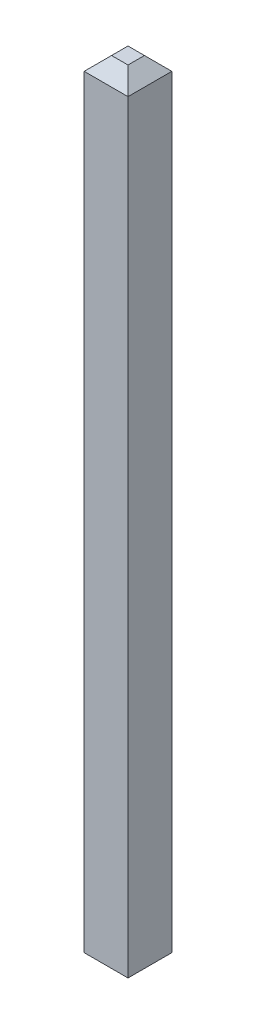
ISO-10303-21;
HEADER;
FILE_DESCRIPTION(('STEP AP214'),'2;1');
FILE_NAME('part.step','',(''),(''),'','','');
FILE_SCHEMA(('AUTOMOTIVE_DESIGN { 1 0 10303 214 1 1 1 1 }'));
ENDSEC;
DATA;
#1=APPLICATION_CONTEXT('core data for automotive mechanical design processes');
#2=APPLICATION_PROTOCOL_DEFINITION('international standard','automotive_design',2000,#1);
#3=PRODUCT_CONTEXT('',#1,'mechanical');
#4=PRODUCT('Part','Part','',(#3));
#5=PRODUCT_RELATED_PRODUCT_CATEGORY('part','',(#4));
#6=PRODUCT_DEFINITION_FORMATION('','',#4);
#7=PRODUCT_DEFINITION_CONTEXT('part definition',#1,'design');
#8=PRODUCT_DEFINITION('design','',#6,#7);
#9=PRODUCT_DEFINITION_SHAPE('','',#8);
#10=(LENGTH_UNIT() NAMED_UNIT(*) SI_UNIT(.MILLI.,.METRE.));
#11=(NAMED_UNIT(*) PLANE_ANGLE_UNIT() SI_UNIT($,.RADIAN.));
#12=(NAMED_UNIT(*) SI_UNIT($,.STERADIAN.) SOLID_ANGLE_UNIT());
#13=UNCERTAINTY_MEASURE_WITH_UNIT(LENGTH_MEASURE(1.E-05),#10,'distance_accuracy_value','');
#14=(GEOMETRIC_REPRESENTATION_CONTEXT(3) GLOBAL_UNCERTAINTY_ASSIGNED_CONTEXT((#13)) GLOBAL_UNIT_ASSIGNED_CONTEXT((#10,
#11,#12)) REPRESENTATION_CONTEXT('',''));
#15=CARTESIAN_POINT('',(0.,0.,0.));
#16=DIRECTION('',(0.,0.,1.));
#17=DIRECTION('',(1.,0.,0.));
#18=AXIS2_PLACEMENT_3D('',#15,#16,#17);
#19=CARTESIAN_POINT('',(9.01,-4.27,-0.32));
#20=DIRECTION('',(-0.707106781186548,0.707106781186548,0.));
#21=DIRECTION('',(-0.707106781186548,-0.707106781186548,0.));
#22=AXIS2_PLACEMENT_3D('',#19,#20,#21);
#23=PLANE('',#22);
#24=DIRECTION('',(0.,0.,1.));
#25=VECTOR('',#24,1.);
#26=CARTESIAN_POINT('',(9.21000000000001,-4.07,-0.32));
#27=LINE('',#26,#25);
#28=CARTESIAN_POINT('',(9.21,-4.07,-0.32));
#29=VERTEX_POINT('',#28);
#30=CARTESIAN_POINT('',(9.21,-4.07,0.32));
#31=VERTEX_POINT('',#30);
#32=EDGE_CURVE('E119',#29,#31,#27,.T.);
#33=ORIENTED_EDGE('',*,*,#32,.T.);
#34=DIRECTION('',(-0.577350269189628,-0.577350269189625,-0.577350269189625));
#35=VECTOR('',#34,1.);
#36=CARTESIAN_POINT('',(9.21,-4.07,0.32));
#37=LINE('',#36,#35);
#38=CARTESIAN_POINT('',(9.01,-4.27,0.12));
#39=VERTEX_POINT('',#38);
#40=EDGE_CURVE('E95',#31,#39,#37,.T.);
#41=ORIENTED_EDGE('',*,*,#40,.T.);
#42=DIRECTION('',(0.,0.,1.));
#43=VECTOR('',#42,1.);
#44=CARTESIAN_POINT('',(9.01,-4.27,-0.32));
#45=LINE('',#44,#43);
#46=CARTESIAN_POINT('',(9.01,-4.27,-0.12));
#47=VERTEX_POINT('',#46);
#48=EDGE_CURVE('E20',#39,#47,#45,.F.);
#49=ORIENTED_EDGE('',*,*,#48,.T.);
#50=DIRECTION('',(-0.577350269189628,-0.577350269189625,0.577350269189624));
#51=VECTOR('',#50,1.);
#52=CARTESIAN_POINT('',(9.21,-4.07,-0.32));
#53=LINE('',#52,#51);
#54=EDGE_CURVE('E84',#29,#47,#53,.T.);
#55=ORIENTED_EDGE('',*,*,#54,.F.);
#56=EDGE_LOOP('',(#33,#41,#49,#55));
#57=FACE_BOUND('',#56,.T.);
#58=ADVANCED_FACE('F17',(#57),#23,.F.);
#59=CARTESIAN_POINT('',(9.21,7.07,-0.32));
#60=DIRECTION('',(-0.707106781186548,-0.707106781186548,0.));
#61=DIRECTION('',(0.707106781186548,-0.707106781186548,0.));
#62=AXIS2_PLACEMENT_3D('',#59,#60,#61);
#63=PLANE('',#62);
#64=DIRECTION('',(0.,0.,1.));
#65=VECTOR('',#64,1.);
#66=CARTESIAN_POINT('',(9.21,7.07,-0.32));
#67=LINE('',#66,#65);
#68=CARTESIAN_POINT('',(9.21,7.07,0.32));
#69=VERTEX_POINT('',#68);
#70=CARTESIAN_POINT('',(9.21,7.07,-0.32));
#71=VERTEX_POINT('',#70);
#72=EDGE_CURVE('E121',#69,#71,#67,.F.);
#73=ORIENTED_EDGE('',*,*,#72,.T.);
#74=DIRECTION('',(0.577350269189629,-0.577350269189626,-0.577350269189623));
#75=VECTOR('',#74,1.);
#76=CARTESIAN_POINT('',(9.01,7.27,-0.12));
#77=LINE('',#76,#75);
#78=CARTESIAN_POINT('',(9.01,7.27,-0.12));
#79=VERTEX_POINT('',#78);
#80=EDGE_CURVE('E78',#79,#71,#77,.T.);
#81=ORIENTED_EDGE('',*,*,#80,.F.);
#82=DIRECTION('',(0.,0.,1.));
#83=VECTOR('',#82,1.);
#84=CARTESIAN_POINT('',(9.01,7.27,-0.32));
#85=LINE('',#84,#83);
#86=CARTESIAN_POINT('',(9.01,7.27,0.12));
#87=VERTEX_POINT('',#86);
#88=EDGE_CURVE('E108',#79,#87,#85,.T.);
#89=ORIENTED_EDGE('',*,*,#88,.T.);
#90=DIRECTION('',(0.577350269189629,-0.577350269189626,0.577350269189623));
#91=VECTOR('',#90,1.);
#92=CARTESIAN_POINT('',(9.01,7.27,0.119999999999999));
#93=LINE('',#92,#91);
#94=EDGE_CURVE('E116',#87,#69,#93,.T.);
#95=ORIENTED_EDGE('',*,*,#94,.T.);
#96=EDGE_LOOP('',(#73,#81,#89,#95));
#97=FACE_BOUND('',#96,.T.);
#98=ADVANCED_FACE('F214',(#97),#63,.F.);
#99=CARTESIAN_POINT('',(9.21,-4.27,-0.32));
#100=DIRECTION('',(0.,1.,0.));
#101=DIRECTION('',(0.,0.,1.));
#102=AXIS2_PLACEMENT_3D('',#99,#100,#101);
#103=PLANE('',#102);
#104=DIRECTION('',(1.,0.,0.));
#105=VECTOR('',#104,1.);
#106=CARTESIAN_POINT('',(9.21,-4.27,0.12));
#107=LINE('',#106,#105);
#108=CARTESIAN_POINT('',(8.77,-4.27,0.12));
#109=VERTEX_POINT('',#108);
#110=EDGE_CURVE('E110',#39,#109,#107,.F.);
#111=ORIENTED_EDGE('',*,*,#110,.T.);
#112=DIRECTION('',(0.,0.,1.));
#113=VECTOR('',#112,1.);
#114=CARTESIAN_POINT('',(8.77,-4.27,-0.32));
#115=LINE('',#114,#113);
#116=CARTESIAN_POINT('',(8.77,-4.27,-0.12));
#117=VERTEX_POINT('',#116);
#118=EDGE_CURVE('E101',#109,#117,#115,.F.);
#119=ORIENTED_EDGE('',*,*,#118,.T.);
#120=DIRECTION('',(1.,0.,0.));
#121=VECTOR('',#120,1.);
#122=CARTESIAN_POINT('',(8.89,-4.27,-0.12));
#123=LINE('',#122,#121);
#124=EDGE_CURVE('E89',#47,#117,#123,.F.);
#125=ORIENTED_EDGE('',*,*,#124,.F.);
#126=ORIENTED_EDGE('',*,*,#48,.F.);
#127=EDGE_LOOP('',(#111,#119,#125,#126));
#128=FACE_BOUND('',#127,.T.);
#129=ADVANCED_FACE('F99',(#128),#103,.F.);
#130=CARTESIAN_POINT('',(8.89,-4.07,-0.32));
#131=DIRECTION('',(0.,-0.707106781186548,-0.707106781186548));
#132=DIRECTION('',(0.,0.707106781186548,-0.707106781186548));
#133=AXIS2_PLACEMENT_3D('',#130,#131,#132);
#134=PLANE('',#133);
#135=ORIENTED_EDGE('',*,*,#54,.T.);
#136=ORIENTED_EDGE('',*,*,#124,.T.);
#137=DIRECTION('',(-0.577350269189624,0.577350269189624,-0.577350269189628));
#138=VECTOR('',#137,1.);
#139=CARTESIAN_POINT('',(8.77,-4.27,-0.12));
#140=LINE('',#139,#138);
#141=CARTESIAN_POINT('',(8.57,-4.07,-0.32));
#142=VERTEX_POINT('',#141);
#143=EDGE_CURVE('E127',#117,#142,#140,.T.);
#144=ORIENTED_EDGE('',*,*,#143,.T.);
#145=DIRECTION('',(-1.,0.,0.));
#146=VECTOR('',#145,1.);
#147=CARTESIAN_POINT('',(8.89,-4.07,-0.320000000000001));
#148=LINE('',#147,#146);
#149=EDGE_CURVE('E91',#29,#142,#148,.T.);
#150=ORIENTED_EDGE('',*,*,#149,.F.);
#151=EDGE_LOOP('',(#135,#136,#144,#150));
#152=FACE_BOUND('',#151,.T.);
#153=ADVANCED_FACE('F86',(#152),#134,.T.);
#154=CARTESIAN_POINT('',(8.89,7.07,-0.32));
#155=DIRECTION('',(0.,0.707106781186548,-0.707106781186548));
#156=DIRECTION('',(0.,0.707106781186548,0.707106781186548));
#157=AXIS2_PLACEMENT_3D('',#154,#155,#156);
#158=PLANE('',#157);
#159=ORIENTED_EDGE('',*,*,#80,.T.);
#160=DIRECTION('',(-1.,0.,0.));
#161=VECTOR('',#160,1.);
#162=CARTESIAN_POINT('',(8.89,7.07,-0.319999999999999));
#163=LINE('',#162,#161);
#164=CARTESIAN_POINT('',(8.57,7.07,-0.32));
#165=VERTEX_POINT('',#164);
#166=EDGE_CURVE('E129',#165,#71,#163,.F.);
#167=ORIENTED_EDGE('',*,*,#166,.F.);
#168=DIRECTION('',(0.577350269189624,0.577350269189624,0.577350269189628));
#169=VECTOR('',#168,1.);
#170=CARTESIAN_POINT('',(8.57,7.07,-0.32));
#171=LINE('',#170,#169);
#172=CARTESIAN_POINT('',(8.77,7.27,-0.120000000000001));
#173=VERTEX_POINT('',#172);
#174=EDGE_CURVE('E136',#165,#173,#171,.T.);
#175=ORIENTED_EDGE('',*,*,#174,.T.);
#176=DIRECTION('',(1.,0.,0.));
#177=VECTOR('',#176,1.);
#178=CARTESIAN_POINT('',(8.57,7.27,-0.12));
#179=LINE('',#178,#177);
#180=EDGE_CURVE('E103',#173,#79,#179,.T.);
#181=ORIENTED_EDGE('',*,*,#180,.T.);
#182=EDGE_LOOP('',(#159,#167,#175,#181));
#183=FACE_BOUND('',#182,.T.);
#184=ADVANCED_FACE('F206',(#183),#158,.T.);
#185=CARTESIAN_POINT('',(8.57,7.27,-0.32));
#186=DIRECTION('',(0.,-1.,0.));
#187=DIRECTION('',(1.,0.,0.));
#188=AXIS2_PLACEMENT_3D('',#185,#186,#187);
#189=PLANE('',#188);
#190=ORIENTED_EDGE('',*,*,#180,.F.);
#191=DIRECTION('',(0.,0.,1.));
#192=VECTOR('',#191,1.);
#193=CARTESIAN_POINT('',(8.77,7.27,-0.32));
#194=LINE('',#193,#192);
#195=CARTESIAN_POINT('',(8.77,7.27,0.12));
#196=VERTEX_POINT('',#195);
#197=EDGE_CURVE('E139',#173,#196,#194,.T.);
#198=ORIENTED_EDGE('',*,*,#197,.T.);
#199=DIRECTION('',(1.,0.,0.));
#200=VECTOR('',#199,1.);
#201=CARTESIAN_POINT('',(8.57,7.27,0.12));
#202=LINE('',#201,#200);
#203=EDGE_CURVE('E113',#196,#87,#202,.T.);
#204=ORIENTED_EDGE('',*,*,#203,.T.);
#205=ORIENTED_EDGE('',*,*,#88,.F.);
#206=EDGE_LOOP('',(#190,#198,#204,#205));
#207=FACE_BOUND('',#206,.T.);
#208=ADVANCED_FACE('F203',(#207),#189,.F.);
#209=CARTESIAN_POINT('',(9.21,-4.27,0.12));
#210=DIRECTION('',(0.,0.707106781186548,-0.707106781186548));
#211=DIRECTION('',(0.,0.707106781186548,0.707106781186548));
#212=AXIS2_PLACEMENT_3D('',#209,#210,#211);
#213=PLANE('',#212);
#214=DIRECTION('',(-1.,0.,0.));
#215=VECTOR('',#214,1.);
#216=CARTESIAN_POINT('',(8.89,-4.07,0.319999999999999));
#217=LINE('',#216,#215);
#218=CARTESIAN_POINT('',(8.57,-4.07,0.32));
#219=VERTEX_POINT('',#218);
#220=EDGE_CURVE('E144',#31,#219,#217,.T.);
#221=ORIENTED_EDGE('',*,*,#220,.T.);
#222=DIRECTION('',(0.577350269189625,-0.577350269189625,-0.577350269189628));
#223=VECTOR('',#222,1.);
#224=CARTESIAN_POINT('',(8.57,-4.07,0.32));
#225=LINE('',#224,#223);
#226=EDGE_CURVE('E123',#219,#109,#225,.T.);
#227=ORIENTED_EDGE('',*,*,#226,.T.);
#228=ORIENTED_EDGE('',*,*,#110,.F.);
#229=ORIENTED_EDGE('',*,*,#40,.F.);
#230=EDGE_LOOP('',(#221,#227,#228,#229));
#231=FACE_BOUND('',#230,.T.);
#232=ADVANCED_FACE('F176',(#231),#213,.F.);
#233=CARTESIAN_POINT('',(8.57,7.27,0.12));
#234=DIRECTION('',(0.,-0.707106781186548,-0.707106781186548));
#235=DIRECTION('',(0.,0.707106781186548,-0.707106781186548));
#236=AXIS2_PLACEMENT_3D('',#233,#234,#235);
#237=PLANE('',#236);
#238=ORIENTED_EDGE('',*,*,#203,.F.);
#239=DIRECTION('',(-0.577350269189625,-0.577350269189625,0.577350269189628));
#240=VECTOR('',#239,1.);
#241=CARTESIAN_POINT('',(8.77,7.27,0.12));
#242=LINE('',#241,#240);
#243=CARTESIAN_POINT('',(8.57,7.07,0.32));
#244=VERTEX_POINT('',#243);
#245=EDGE_CURVE('E142',#196,#244,#242,.T.);
#246=ORIENTED_EDGE('',*,*,#245,.T.);
#247=DIRECTION('',(-1.,0.,0.));
#248=VECTOR('',#247,1.);
#249=CARTESIAN_POINT('',(8.89,7.07,0.320000000000001));
#250=LINE('',#249,#248);
#251=EDGE_CURVE('E34',#244,#69,#250,.F.);
#252=ORIENTED_EDGE('',*,*,#251,.T.);
#253=ORIENTED_EDGE('',*,*,#94,.F.);
#254=EDGE_LOOP('',(#238,#246,#252,#253));
#255=FACE_BOUND('',#254,.T.);
#256=ADVANCED_FACE('F196',(#255),#237,.F.);
#257=CARTESIAN_POINT('',(9.21,7.27,-0.32));
#258=DIRECTION('',(-1.,0.,0.));
#259=DIRECTION('',(0.,-1.,0.));
#260=AXIS2_PLACEMENT_3D('',#257,#258,#259);
#261=PLANE('',#260);
#262=ORIENTED_EDGE('',*,*,#72,.F.);
#263=DIRECTION('',(0.,1.,0.));
#264=VECTOR('',#263,1.);
#265=CARTESIAN_POINT('',(9.21,1.5,0.32));
#266=LINE('',#265,#264);
#267=EDGE_CURVE('E148',#69,#31,#266,.F.);
#268=ORIENTED_EDGE('',*,*,#267,.T.);
#269=ORIENTED_EDGE('',*,*,#32,.F.);
#270=DIRECTION('',(0.,1.,0.));
#271=VECTOR('',#270,1.);
#272=CARTESIAN_POINT('',(9.21,1.5,-0.32));
#273=LINE('',#272,#271);
#274=EDGE_CURVE('E132',#71,#29,#273,.F.);
#275=ORIENTED_EDGE('',*,*,#274,.F.);
#276=EDGE_LOOP('',(#262,#268,#269,#275));
#277=FACE_BOUND('',#276,.T.);
#278=ADVANCED_FACE('F193',(#277),#261,.F.);
#279=CARTESIAN_POINT('',(8.57,-4.07,-0.32));
#280=DIRECTION('',(0.707106781186548,0.707106781186548,0.));
#281=DIRECTION('',(-0.707106781186548,0.707106781186548,0.));
#282=AXIS2_PLACEMENT_3D('',#279,#280,#281);
#283=PLANE('',#282);
#284=ORIENTED_EDGE('',*,*,#118,.F.);
#285=ORIENTED_EDGE('',*,*,#226,.F.);
#286=DIRECTION('',(0.,0.,-1.));
#287=VECTOR('',#286,1.);
#288=CARTESIAN_POINT('',(8.57,-4.07,-0.32));
#289=LINE('',#288,#287);
#290=EDGE_CURVE('E151',#219,#142,#289,.T.);
#291=ORIENTED_EDGE('',*,*,#290,.T.);
#292=ORIENTED_EDGE('',*,*,#143,.F.);
#293=EDGE_LOOP('',(#284,#285,#291,#292));
#294=FACE_BOUND('',#293,.T.);
#295=ADVANCED_FACE('F173',(#294),#283,.F.);
#296=CARTESIAN_POINT('',(8.89,1.5,-0.32));
#297=DIRECTION('',(0.,0.,-1.));
#298=DIRECTION('',(-1.,0.,0.));
#299=AXIS2_PLACEMENT_3D('',#296,#297,#298);
#300=PLANE('',#299);
#301=ORIENTED_EDGE('',*,*,#274,.T.);
#302=ORIENTED_EDGE('',*,*,#149,.T.);
#303=DIRECTION('',(0.,1.,0.));
#304=VECTOR('',#303,1.);
#305=CARTESIAN_POINT('',(8.57,-4.27,-0.32));
#306=LINE('',#305,#304);
#307=EDGE_CURVE('E154',#142,#165,#306,.T.);
#308=ORIENTED_EDGE('',*,*,#307,.T.);
#309=ORIENTED_EDGE('',*,*,#166,.T.);
#310=EDGE_LOOP('',(#301,#302,#308,#309));
#311=FACE_BOUND('',#310,.T.);
#312=ADVANCED_FACE('F170',(#311),#300,.T.);
#313=CARTESIAN_POINT('',(8.77,7.27,-0.32));
#314=DIRECTION('',(0.707106781186548,-0.707106781186548,0.));
#315=DIRECTION('',(0.707106781186548,0.707106781186548,0.));
#316=AXIS2_PLACEMENT_3D('',#313,#314,#315);
#317=PLANE('',#316);
#318=ORIENTED_EDGE('',*,*,#197,.F.);
#319=ORIENTED_EDGE('',*,*,#174,.F.);
#320=DIRECTION('',(0.,0.,-1.));
#321=VECTOR('',#320,1.);
#322=CARTESIAN_POINT('',(8.57,7.07,-0.32));
#323=LINE('',#322,#321);
#324=EDGE_CURVE('E26',#165,#244,#323,.F.);
#325=ORIENTED_EDGE('',*,*,#324,.T.);
#326=ORIENTED_EDGE('',*,*,#245,.F.);
#327=EDGE_LOOP('',(#318,#319,#325,#326));
#328=FACE_BOUND('',#327,.T.);
#329=ADVANCED_FACE('F162',(#328),#317,.F.);
#330=CARTESIAN_POINT('',(8.89,1.5,0.32));
#331=DIRECTION('',(0.,0.,-1.));
#332=DIRECTION('',(-1.,0.,0.));
#333=AXIS2_PLACEMENT_3D('',#330,#331,#332);
#334=PLANE('',#333);
#335=ORIENTED_EDGE('',*,*,#251,.F.);
#336=DIRECTION('',(0.,1.,0.));
#337=VECTOR('',#336,1.);
#338=CARTESIAN_POINT('',(8.57,-4.27,0.32));
#339=LINE('',#338,#337);
#340=EDGE_CURVE('E11',#244,#219,#339,.F.);
#341=ORIENTED_EDGE('',*,*,#340,.T.);
#342=ORIENTED_EDGE('',*,*,#220,.F.);
#343=ORIENTED_EDGE('',*,*,#267,.F.);
#344=EDGE_LOOP('',(#335,#341,#342,#343));
#345=FACE_BOUND('',#344,.T.);
#346=ADVANCED_FACE('F177',(#345),#334,.F.);
#347=CARTESIAN_POINT('',(8.57,-4.27,-0.32));
#348=DIRECTION('',(1.,0.,0.));
#349=DIRECTION('',(0.,0.,-1.));
#350=AXIS2_PLACEMENT_3D('',#347,#348,#349);
#351=PLANE('',#350);
#352=ORIENTED_EDGE('',*,*,#324,.F.);
#353=ORIENTED_EDGE('',*,*,#307,.F.);
#354=ORIENTED_EDGE('',*,*,#290,.F.);
#355=ORIENTED_EDGE('',*,*,#340,.F.);
#356=EDGE_LOOP('',(#352,#353,#354,#355));
#357=FACE_BOUND('',#356,.T.);
#358=ADVANCED_FACE('F167',(#357),#351,.F.);
#359=CLOSED_SHELL('',(#58,#98,#129,#153,#184,#208,#232,#256,#278,#295,#312,#329,#346,#358));
#360=MANIFOLD_SOLID_BREP('B1',#359);
#361=ADVANCED_BREP_SHAPE_REPRESENTATION('',(#18,#360),#14);
#362=SHAPE_DEFINITION_REPRESENTATION(#9,#361);
ENDSEC;
END-ISO-10303-21;
